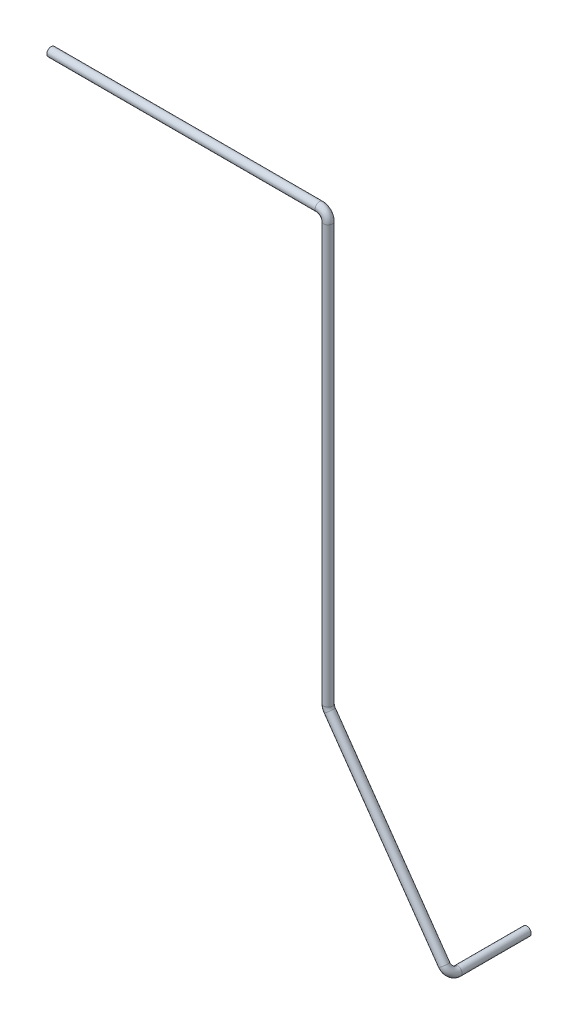
ISO-10303-21;
HEADER;
FILE_DESCRIPTION(('STEP AP214'),'2;1');
FILE_NAME('part.step','',(''),(''),'','','');
FILE_SCHEMA(('AUTOMOTIVE_DESIGN { 1 0 10303 214 1 1 1 1 }'));
ENDSEC;
DATA;
#1=APPLICATION_CONTEXT('core data for automotive mechanical design processes');
#2=APPLICATION_PROTOCOL_DEFINITION('international standard','automotive_design',2000,#1);
#3=PRODUCT_CONTEXT('',#1,'mechanical');
#4=PRODUCT('Part','Part','',(#3));
#5=PRODUCT_RELATED_PRODUCT_CATEGORY('part','',(#4));
#6=PRODUCT_DEFINITION_FORMATION('','',#4);
#7=PRODUCT_DEFINITION_CONTEXT('part definition',#1,'design');
#8=PRODUCT_DEFINITION('design','',#6,#7);
#9=PRODUCT_DEFINITION_SHAPE('','',#8);
#10=(LENGTH_UNIT() NAMED_UNIT(*) SI_UNIT(.MILLI.,.METRE.));
#11=(NAMED_UNIT(*) PLANE_ANGLE_UNIT() SI_UNIT($,.RADIAN.));
#12=(NAMED_UNIT(*) SI_UNIT($,.STERADIAN.) SOLID_ANGLE_UNIT());
#13=UNCERTAINTY_MEASURE_WITH_UNIT(LENGTH_MEASURE(1.E-05),#10,'distance_accuracy_value','');
#14=(GEOMETRIC_REPRESENTATION_CONTEXT(3) GLOBAL_UNCERTAINTY_ASSIGNED_CONTEXT((#13)) GLOBAL_UNIT_ASSIGNED_CONTEXT((#10,
#11,#12)) REPRESENTATION_CONTEXT('',''));
#15=CARTESIAN_POINT('',(0.,0.,0.));
#16=DIRECTION('',(0.,0.,1.));
#17=DIRECTION('',(1.,0.,0.));
#18=AXIS2_PLACEMENT_3D('',#15,#16,#17);
#19=CARTESIAN_POINT('',(-31243.2781005083,-14167.0136339468,40791.8371076466));
#20=DIRECTION('',(-1.,0.,0.));
#21=DIRECTION('',(0.,0.818643838091512,0.574301546537007));
#22=AXIS2_PLACEMENT_3D('',#19,#20,#21);
#23=PLANE('',#22);
#24=CARTESIAN_POINT('',(-31243.2781005083,-14167.0136339468,40791.8371076466));
#25=DIRECTION('',(-1.,0.,0.));
#26=DIRECTION('',(0.,-1.,0.));
#27=AXIS2_PLACEMENT_3D('',#24,#25,#26);
#28=CIRCLE('',#27,14.0000000000006);
#29=CARTESIAN_POINT('',(-31243.2781005083,-14181.0136339468,40791.8371076466));
#30=VERTEX_POINT('',#29);
#31=EDGE_CURVE('E82',#30,#30,#28,.T.);
#32=ORIENTED_EDGE('',*,*,#31,.F.);
#33=EDGE_LOOP('',(#32));
#34=FACE_BOUND('',#33,.T.);
#35=CARTESIAN_POINT('',(-31243.2781005083,-14167.0136339468,40791.8371076466));
#36=DIRECTION('',(-1.,0.,0.));
#37=DIRECTION('',(0.,0.818643838091512,0.574301546537007));
#38=AXIS2_PLACEMENT_3D('',#35,#36,#37);
#39=CIRCLE('',#38,15.0000000000006);
#40=CARTESIAN_POINT('',(-31243.2781005083,-14154.7339763754,40800.4516308447));
#41=VERTEX_POINT('',#40);
#42=EDGE_CURVE('E75',#41,#41,#39,.T.);
#43=ORIENTED_EDGE('',*,*,#42,.T.);
#44=EDGE_LOOP('',(#43));
#45=FACE_BOUND('',#44,.T.);
#46=ADVANCED_FACE('F47',(#34,#45),#23,.T.);
#47=CARTESIAN_POINT('',(-29859.7978557255,-16257.8595632953,40521.7031960563));
#48=DIRECTION('',(0.,0.,1.));
#49=DIRECTION('',(1.,0.,0.));
#50=AXIS2_PLACEMENT_3D('',#47,#48,#49);
#51=PLANE('',#50);
#52=CARTESIAN_POINT('',(-29859.7978557255,-16257.8595632953,40521.7031960563));
#53=DIRECTION('',(0.,0.,1.));
#54=DIRECTION('',(1.,0.,0.));
#55=AXIS2_PLACEMENT_3D('',#52,#53,#54);
#56=CIRCLE('',#55,14.0000000000006);
#57=CARTESIAN_POINT('',(-29845.7978557255,-16257.8595632953,40521.7031960563));
#58=VERTEX_POINT('',#57);
#59=EDGE_CURVE('E78',#58,#58,#56,.T.);
#60=ORIENTED_EDGE('',*,*,#59,.T.);
#61=EDGE_LOOP('',(#60));
#62=FACE_BOUND('',#61,.T.);
#63=CARTESIAN_POINT('',(-29859.7978557255,-16257.8595632953,40521.7031960563));
#64=DIRECTION('',(0.,0.,1.));
#65=DIRECTION('',(1.,0.,0.));
#66=AXIS2_PLACEMENT_3D('',#63,#64,#65);
#67=CIRCLE('',#66,15.0000000000006);
#68=CARTESIAN_POINT('',(-29844.7978557255,-16257.8595632953,40521.7031960563));
#69=VERTEX_POINT('',#68);
#70=EDGE_CURVE('E11',#69,#69,#67,.T.);
#71=ORIENTED_EDGE('',*,*,#70,.F.);
#72=EDGE_LOOP('',(#71));
#73=FACE_BOUND('',#72,.T.);
#74=ADVANCED_FACE('F114',(#62,#73),#51,.F.);
#75=CARTESIAN_POINT('',(-31243.2781005083,-14167.0136339468,40791.8371076466));
#76=DIRECTION('',(1.,0.,0.));
#77=DIRECTION('',(0.,0.,-1.));
#78=AXIS2_PLACEMENT_3D('',#75,#76,#77);
#79=CYLINDRICAL_SURFACE('',#78,15.0000000000006);
#80=CARTESIAN_POINT('',(-30310.4639661704,-14167.0136339468,40791.8371076466));
#81=DIRECTION('',(-1.,0.,0.));
#82=DIRECTION('',(0.,0.818643838091512,0.574301546537007));
#83=AXIS2_PLACEMENT_3D('',#80,#81,#82);
#84=CIRCLE('',#83,15.0000000000006);
#85=CARTESIAN_POINT('',(-30310.4639661704,-14152.0136339468,40791.8371076466));
#86=VERTEX_POINT('',#85);
#87=EDGE_CURVE('E72',#86,#86,#84,.T.);
#88=ORIENTED_EDGE('',*,*,#87,.T.);
#89=EDGE_LOOP('',(#88));
#90=FACE_BOUND('',#89,.T.);
#91=ORIENTED_EDGE('',*,*,#42,.F.);
#92=EDGE_LOOP('',(#91));
#93=FACE_BOUND('',#92,.T.);
#94=ADVANCED_FACE('F118',(#90,#93),#79,.T.);
#95=CARTESIAN_POINT('',(-30310.4639661704,-14197.0136339468,40791.8371076466));
#96=DIRECTION('',(0.,0.,-1.));
#97=DIRECTION('',(-1.,0.,0.));
#98=AXIS2_PLACEMENT_3D('',#95,#96,#97);
#99=TOROIDAL_SURFACE('',#98,30.0000000000011,15.0000000000006);
#100=CARTESIAN_POINT('',(-30280.4639661704,-14197.0136339468,40791.8371076466));
#101=DIRECTION('',(0.,1.,0.));
#102=DIRECTION('',(0.818643838091512,0.,0.574301546537007));
#103=AXIS2_PLACEMENT_3D('',#100,#101,#102);
#104=CIRCLE('',#103,15.0000000000006);
#105=CARTESIAN_POINT('',(-30265.4639661704,-14197.0136339468,40791.8371076466));
#106=VERTEX_POINT('',#105);
#107=EDGE_CURVE('E69',#106,#106,#104,.T.);
#108=CARTESIAN_POINT('',(-30310.4639661704,-14197.0136339468,40791.8371076466));
#109=DIRECTION('',(0.,0.,-1.));
#110=DIRECTION('',(-1.,0.,0.));
#111=AXIS2_PLACEMENT_3D('',#108,#109,#110);
#112=CIRCLE('',#111,45.0000000000017);
#113=EDGE_CURVE('',#86,#106,#112,.T.);
#114=ORIENTED_EDGE('',*,*,#87,.F.);
#115=ORIENTED_EDGE('',*,*,#107,.T.);
#116=ORIENTED_EDGE('',*,*,#113,.T.);
#117=ORIENTED_EDGE('',*,*,#113,.F.);
#118=EDGE_LOOP('',(#114,#116,#115,#117));
#119=FACE_BOUND('',#118,.T.);
#120=ADVANCED_FACE('F120',(#119),#99,.T.);
#121=CARTESIAN_POINT('',(-30280.4639661704,-14197.0136339468,40791.8371076466));
#122=DIRECTION('',(0.,-1.,0.));
#123=DIRECTION('',(0.,0.,-1.));
#124=AXIS2_PLACEMENT_3D('',#121,#122,#123);
#125=CYLINDRICAL_SURFACE('',#124,15.0000000000006);
#126=CARTESIAN_POINT('',(-30280.4639661704,-15648.7433138681,40791.8371076466));
#127=DIRECTION('',(0.,1.,0.));
#128=DIRECTION('',(0.818643838091512,0.,0.574301546537007));
#129=AXIS2_PLACEMENT_3D('',#126,#127,#128);
#130=CIRCLE('',#129,15.0000000000006);
#131=CARTESIAN_POINT('',(-30295.4639661704,-15648.7433138681,40791.8371076466));
#132=VERTEX_POINT('',#131);
#133=EDGE_CURVE('E66',#132,#132,#130,.T.);
#134=ORIENTED_EDGE('',*,*,#133,.T.);
#135=EDGE_LOOP('',(#134));
#136=FACE_BOUND('',#135,.T.);
#137=ORIENTED_EDGE('',*,*,#107,.F.);
#138=EDGE_LOOP('',(#137));
#139=FACE_BOUND('',#138,.T.);
#140=ADVANCED_FACE('F127',(#136,#139),#125,.T.);
#141=CARTESIAN_POINT('',(-30250.4639661704,-15648.7433138681,40791.8371076466));
#142=DIRECTION('',(0.,0.,1.));
#143=DIRECTION('',(1.,0.,0.));
#144=AXIS2_PLACEMENT_3D('',#141,#142,#143);
#145=TOROIDAL_SURFACE('',#144,30.0000000000011,15.0000000000006);
#146=CARTESIAN_POINT('',(-30275.0232813131,-15665.9723602642,40791.8371076466));
#147=DIRECTION('',(-0.574301546536938,0.81864383809156,0.));
#148=DIRECTION('',(0.670177733645249,0.470148422278878,0.574301546537007));
#149=AXIS2_PLACEMENT_3D('',#146,#147,#148);
#150=CIRCLE('',#149,15.0000000000006);
#151=CARTESIAN_POINT('',(-30287.3029388845,-15674.5868834622,40791.8371076466));
#152=VERTEX_POINT('',#151);
#153=EDGE_CURVE('E61',#152,#152,#150,.T.);
#154=CARTESIAN_POINT('',(-30250.4639661704,-15648.7433138681,40791.8371076466));
#155=DIRECTION('',(0.,0.,1.));
#156=DIRECTION('',(1.,0.,0.));
#157=AXIS2_PLACEMENT_3D('',#154,#155,#156);
#158=CIRCLE('',#157,45.0000000000017);
#159=EDGE_CURVE('',#132,#152,#158,.T.);
#160=ORIENTED_EDGE('',*,*,#133,.F.);
#161=ORIENTED_EDGE('',*,*,#153,.T.);
#162=ORIENTED_EDGE('',*,*,#159,.T.);
#163=ORIENTED_EDGE('',*,*,#159,.F.);
#164=EDGE_LOOP('',(#160,#162,#161,#163));
#165=FACE_BOUND('',#164,.T.);
#166=ADVANCED_FACE('F144',(#165),#145,.T.);
#167=CARTESIAN_POINT('',(-30275.0232813131,-15665.9723602642,40791.8371076466));
#168=DIRECTION('',(0.574301546536962,-0.818643838091543,0.));
#169=DIRECTION('',(0.818643838091544,0.574301546536962,0.));
#170=AXIS2_PLACEMENT_3D('',#167,#168,#169);
#171=CYLINDRICAL_SURFACE('',#170,15.0000000000006);
#172=CARTESIAN_POINT('',(-29877.0269021217,-16233.3002481526,40791.8371076466));
#173=DIRECTION('',(-0.574301546536932,0.818643838091564,0.));
#174=DIRECTION('',(0.670177733645253,0.470148422278873,0.574301546537007));
#175=AXIS2_PLACEMENT_3D('',#172,#173,#174);
#176=CIRCLE('',#175,15.0000000000006);
#177=CARTESIAN_POINT('',(-29877.0269021217,-16233.3002481526,40806.8371076466));
#178=VERTEX_POINT('',#177);
#179=EDGE_CURVE('E57',#178,#178,#176,.T.);
#180=ORIENTED_EDGE('',*,*,#179,.T.);
#181=EDGE_LOOP('',(#180));
#182=FACE_BOUND('',#181,.T.);
#183=ORIENTED_EDGE('',*,*,#153,.F.);
#184=EDGE_LOOP('',(#183));
#185=FACE_BOUND('',#184,.T.);
#186=ADVANCED_FACE('F138',(#182,#185),#171,.T.);
#187=CARTESIAN_POINT('',(-29877.0269021217,-16233.3002481526,40761.8371076466));
#188=DIRECTION('',(0.818643838091512,0.574301546537008,0.));
#189=DIRECTION('',(-0.574301546537008,0.818643838091512,0.));
#190=AXIS2_PLACEMENT_3D('',#187,#188,#189);
#191=TOROIDAL_SURFACE('',#190,30.0000000000011,15.0000000000006);
#192=CARTESIAN_POINT('',(-29859.7978557273,-16257.8595632953,40761.8371076453));
#193=DIRECTION('',(0.,0.,1.));
#194=DIRECTION('',(1.,0.,0.));
#195=AXIS2_PLACEMENT_3D('',#192,#193,#194);
#196=CIRCLE('',#195,15.0000000000006);
#197=CARTESIAN_POINT('',(-29851.1833325293,-16270.139220868,40761.8371076446));
#198=VERTEX_POINT('',#197);
#199=EDGE_CURVE('E53',#198,#198,#196,.T.);
#200=CARTESIAN_POINT('',(-29877.0269021217,-16233.3002481526,40761.8371076466));
#201=DIRECTION('',(0.818643838091512,0.574301546537008,0.));
#202=DIRECTION('',(-0.574301546537008,0.818643838091512,0.));
#203=AXIS2_PLACEMENT_3D('',#200,#201,#202);
#204=CIRCLE('',#203,45.0000000000017);
#205=EDGE_CURVE('',#178,#198,#204,.T.);
#206=ORIENTED_EDGE('',*,*,#179,.F.);
#207=ORIENTED_EDGE('',*,*,#199,.T.);
#208=ORIENTED_EDGE('',*,*,#205,.T.);
#209=ORIENTED_EDGE('',*,*,#205,.F.);
#210=EDGE_LOOP('',(#206,#208,#207,#209));
#211=FACE_BOUND('',#210,.T.);
#212=ADVANCED_FACE('F133',(#211),#191,.T.);
#213=CARTESIAN_POINT('',(-29859.7978557255,-16257.8595632953,40761.8371076466));
#214=DIRECTION('',(0.,0.,-1.));
#215=DIRECTION('',(-1.,0.,0.));
#216=AXIS2_PLACEMENT_3D('',#213,#214,#215);
#217=CYLINDRICAL_SURFACE('',#216,15.0000000000006);
#218=ORIENTED_EDGE('',*,*,#70,.T.);
#219=EDGE_LOOP('',(#218));
#220=FACE_BOUND('',#219,.T.);
#221=ORIENTED_EDGE('',*,*,#199,.F.);
#222=EDGE_LOOP('',(#221));
#223=FACE_BOUND('',#222,.T.);
#224=ADVANCED_FACE('F108',(#220,#223),#217,.T.);
#225=CARTESIAN_POINT('',(-31243.2781005083,-14167.0136339468,40791.8371076466));
#226=DIRECTION('',(1.,0.,0.));
#227=DIRECTION('',(0.,0.,-1.));
#228=AXIS2_PLACEMENT_3D('',#225,#226,#227);
#229=CYLINDRICAL_SURFACE('',#228,14.0000000000006);
#230=CARTESIAN_POINT('',(-30310.4639661704,-14167.0136339468,40791.8371076466));
#231=DIRECTION('',(1.,0.,0.));
#232=DIRECTION('',(0.,0.,-1.));
#233=AXIS2_PLACEMENT_3D('',#230,#231,#232);
#234=CIRCLE('',#233,14.0000000000006);
#235=CARTESIAN_POINT('',(-30310.4639661704,-14153.0136339468,40791.8371076466));
#236=VERTEX_POINT('',#235);
#237=EDGE_CURVE('E85',#236,#236,#234,.F.);
#238=ORIENTED_EDGE('',*,*,#237,.F.);
#239=EDGE_LOOP('',(#238));
#240=FACE_BOUND('',#239,.T.);
#241=ORIENTED_EDGE('',*,*,#31,.T.);
#242=EDGE_LOOP('',(#241));
#243=FACE_BOUND('',#242,.T.);
#244=ADVANCED_FACE('F105',(#240,#243),#229,.F.);
#245=CARTESIAN_POINT('',(-30310.4639661704,-14197.0136339468,40791.8371076466));
#246=DIRECTION('',(0.,0.,-1.));
#247=DIRECTION('',(-1.,0.,0.));
#248=AXIS2_PLACEMENT_3D('',#245,#246,#247);
#249=TOROIDAL_SURFACE('',#248,30.0000000000011,14.0000000000006);
#250=CARTESIAN_POINT('',(-30280.4639661704,-14197.0136339468,40791.8371076466));
#251=DIRECTION('',(2.00161768962464E-13,1.,0.));
#252=DIRECTION('',(-1.,2.00161768962464E-13,0.));
#253=AXIS2_PLACEMENT_3D('',#250,#251,#252);
#254=CIRCLE('',#253,14.0000000000006);
#255=CARTESIAN_POINT('',(-30266.4639661704,-14197.0136339468,40791.8371076466));
#256=VERTEX_POINT('',#255);
#257=EDGE_CURVE('E97',#256,#256,#254,.T.);
#258=CARTESIAN_POINT('',(-30310.4639661704,-14197.0136339468,40791.8371076466));
#259=DIRECTION('',(0.,0.,-1.));
#260=DIRECTION('',(-1.,0.,0.));
#261=AXIS2_PLACEMENT_3D('',#258,#259,#260);
#262=CIRCLE('',#261,44.0000000000017);
#263=EDGE_CURVE('',#236,#256,#262,.T.);
#264=ORIENTED_EDGE('',*,*,#237,.T.);
#265=ORIENTED_EDGE('',*,*,#257,.F.);
#266=ORIENTED_EDGE('',*,*,#263,.T.);
#267=ORIENTED_EDGE('',*,*,#263,.F.);
#268=EDGE_LOOP('',(#264,#266,#265,#267));
#269=FACE_BOUND('',#268,.T.);
#270=ADVANCED_FACE('F103',(#269),#249,.F.);
#271=CARTESIAN_POINT('',(-30280.4639661704,-14197.0136339468,40791.8371076466));
#272=DIRECTION('',(0.,-1.,0.));
#273=DIRECTION('',(0.,0.,-1.));
#274=AXIS2_PLACEMENT_3D('',#271,#272,#273);
#275=CYLINDRICAL_SURFACE('',#274,14.0000000000006);
#276=CARTESIAN_POINT('',(-30280.4639661704,-15648.7433138681,40791.8371076466));
#277=DIRECTION('',(0.,-1.,0.));
#278=DIRECTION('',(0.,0.,-1.));
#279=AXIS2_PLACEMENT_3D('',#276,#277,#278);
#280=CIRCLE('',#279,14.0000000000006);
#281=CARTESIAN_POINT('',(-30294.4639661704,-15648.7433138681,40791.8371076466));
#282=VERTEX_POINT('',#281);
#283=EDGE_CURVE('E94',#282,#282,#280,.F.);
#284=ORIENTED_EDGE('',*,*,#283,.F.);
#285=EDGE_LOOP('',(#284));
#286=FACE_BOUND('',#285,.T.);
#287=ORIENTED_EDGE('',*,*,#257,.T.);
#288=EDGE_LOOP('',(#287));
#289=FACE_BOUND('',#288,.T.);
#290=ADVANCED_FACE('F195',(#286,#289),#275,.F.);
#291=CARTESIAN_POINT('',(-30250.4639661704,-15648.7433138681,40791.8371076466));
#292=DIRECTION('',(0.,0.,1.));
#293=DIRECTION('',(1.,0.,0.));
#294=AXIS2_PLACEMENT_3D('',#291,#292,#293);
#295=TOROIDAL_SURFACE('',#294,30.0000000000011,14.0000000000006);
#296=CARTESIAN_POINT('',(-30275.0232813131,-15665.9723602642,40791.8371076466));
#297=DIRECTION('',(-0.574301546537117,0.818643838091435,0.));
#298=DIRECTION('',(-0.818643838091435,-0.574301546537117,0.));
#299=AXIS2_PLACEMENT_3D('',#296,#297,#298);
#300=CIRCLE('',#299,14.0000000000006);
#301=CARTESIAN_POINT('',(-30286.4842950464,-15674.0125819157,40791.8371076466));
#302=VERTEX_POINT('',#301);
#303=EDGE_CURVE('E91',#302,#302,#300,.T.);
#304=CARTESIAN_POINT('',(-30250.4639661704,-15648.7433138681,40791.8371076466));
#305=DIRECTION('',(0.,0.,1.));
#306=DIRECTION('',(1.,0.,0.));
#307=AXIS2_PLACEMENT_3D('',#304,#305,#306);
#308=CIRCLE('',#307,44.0000000000017);
#309=EDGE_CURVE('',#282,#302,#308,.T.);
#310=ORIENTED_EDGE('',*,*,#283,.T.);
#311=ORIENTED_EDGE('',*,*,#303,.F.);
#312=ORIENTED_EDGE('',*,*,#309,.T.);
#313=ORIENTED_EDGE('',*,*,#309,.F.);
#314=EDGE_LOOP('',(#310,#312,#311,#313));
#315=FACE_BOUND('',#314,.T.);
#316=ADVANCED_FACE('F206',(#315),#295,.F.);
#317=CARTESIAN_POINT('',(-30275.0232813131,-15665.9723602642,40791.8371076466));
#318=DIRECTION('',(0.574301546536962,-0.818643838091543,0.));
#319=DIRECTION('',(0.818643838091544,0.574301546536962,0.));
#320=AXIS2_PLACEMENT_3D('',#317,#318,#319);
#321=CYLINDRICAL_SURFACE('',#320,14.0000000000006);
#322=CARTESIAN_POINT('',(-29877.0269021217,-16233.3002481526,40791.8371076466));
#323=DIRECTION('',(0.574301546536962,-0.818643838091543,0.));
#324=DIRECTION('',(0.818643838091544,0.574301546536962,0.));
#325=AXIS2_PLACEMENT_3D('',#322,#323,#324);
#326=CIRCLE('',#325,14.0000000000006);
#327=CARTESIAN_POINT('',(-29877.0269021217,-16233.3002481526,40805.8371076466));
#328=VERTEX_POINT('',#327);
#329=EDGE_CURVE('E88',#328,#328,#326,.F.);
#330=ORIENTED_EDGE('',*,*,#329,.F.);
#331=EDGE_LOOP('',(#330));
#332=FACE_BOUND('',#331,.T.);
#333=ORIENTED_EDGE('',*,*,#303,.T.);
#334=EDGE_LOOP('',(#333));
#335=FACE_BOUND('',#334,.T.);
#336=ADVANCED_FACE('F217',(#332,#335),#321,.F.);
#337=CARTESIAN_POINT('',(-29877.0269021217,-16233.3002481526,40761.8371076466));
#338=DIRECTION('',(0.818643838091512,0.574301546537008,0.));
#339=DIRECTION('',(-0.574301546537008,0.818643838091512,0.));
#340=AXIS2_PLACEMENT_3D('',#337,#338,#339);
#341=TOROIDAL_SURFACE('',#340,30.0000000000011,14.0000000000006);
#342=CARTESIAN_POINT('',(-29859.7978557255,-16257.8595632953,40761.8371076453));
#343=DIRECTION('',(0.,0.,-1.));
#344=DIRECTION('',(-1.,0.,0.));
#345=AXIS2_PLACEMENT_3D('',#342,#343,#344);
#346=CIRCLE('',#345,14.0000000000006);
#347=CARTESIAN_POINT('',(-29851.757634074,-16269.3205770286,40761.8371076447));
#348=VERTEX_POINT('',#347);
#349=EDGE_CURVE('E81',#348,#348,#346,.F.);
#350=CARTESIAN_POINT('',(-29877.0269021217,-16233.3002481526,40761.8371076466));
#351=DIRECTION('',(0.818643838091512,0.574301546537008,0.));
#352=DIRECTION('',(-0.574301546537008,0.818643838091512,0.));
#353=AXIS2_PLACEMENT_3D('',#350,#351,#352);
#354=CIRCLE('',#353,44.0000000000017);
#355=EDGE_CURVE('',#328,#348,#354,.T.);
#356=ORIENTED_EDGE('',*,*,#329,.T.);
#357=ORIENTED_EDGE('',*,*,#349,.F.);
#358=ORIENTED_EDGE('',*,*,#355,.T.);
#359=ORIENTED_EDGE('',*,*,#355,.F.);
#360=EDGE_LOOP('',(#356,#358,#357,#359));
#361=FACE_BOUND('',#360,.T.);
#362=ADVANCED_FACE('F228',(#361),#341,.F.);
#363=CARTESIAN_POINT('',(-29859.7978557255,-16257.8595632953,40761.8371076466));
#364=DIRECTION('',(0.,0.,-1.));
#365=DIRECTION('',(-1.,0.,0.));
#366=AXIS2_PLACEMENT_3D('',#363,#364,#365);
#367=CYLINDRICAL_SURFACE('',#366,14.0000000000006);
#368=ORIENTED_EDGE('',*,*,#59,.F.);
#369=EDGE_LOOP('',(#368));
#370=FACE_BOUND('',#369,.T.);
#371=ORIENTED_EDGE('',*,*,#349,.T.);
#372=EDGE_LOOP('',(#371));
#373=FACE_BOUND('',#372,.T.);
#374=ADVANCED_FACE('F115',(#370,#373),#367,.F.);
#375=CLOSED_SHELL('',(#46,#74,#94,#120,#140,#166,#186,#212,#224,#244,#270,#290,#316,#336,#362,#374));
#376=MANIFOLD_SOLID_BREP('B2',#375);
#377=ADVANCED_BREP_SHAPE_REPRESENTATION('',(#18,#376),#14);
#378=SHAPE_DEFINITION_REPRESENTATION(#9,#377);
ENDSEC;
END-ISO-10303-21;
